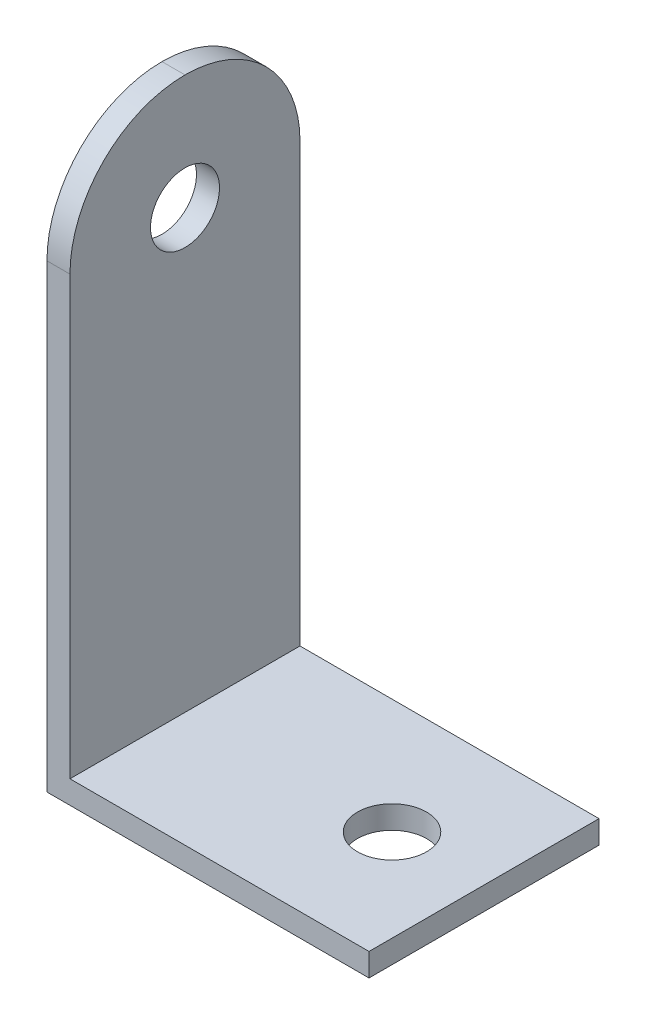
ISO-10303-21;
HEADER;
FILE_DESCRIPTION(('STEP AP214'),'2;1');
FILE_NAME('part.step','',(''),(''),'','','');
FILE_SCHEMA(('AUTOMOTIVE_DESIGN { 1 0 10303 214 1 1 1 1 }'));
ENDSEC;
DATA;
#1=APPLICATION_CONTEXT('core data for automotive mechanical design processes');
#2=APPLICATION_PROTOCOL_DEFINITION('international standard','automotive_design',2000,#1);
#3=PRODUCT_CONTEXT('',#1,'mechanical');
#4=PRODUCT('Part','Part','',(#3));
#5=PRODUCT_RELATED_PRODUCT_CATEGORY('part','',(#4));
#6=PRODUCT_DEFINITION_FORMATION('','',#4);
#7=PRODUCT_DEFINITION_CONTEXT('part definition',#1,'design');
#8=PRODUCT_DEFINITION('design','',#6,#7);
#9=PRODUCT_DEFINITION_SHAPE('','',#8);
#10=(LENGTH_UNIT() NAMED_UNIT(*) SI_UNIT(.MILLI.,.METRE.));
#11=(NAMED_UNIT(*) PLANE_ANGLE_UNIT() SI_UNIT($,.RADIAN.));
#12=(NAMED_UNIT(*) SI_UNIT($,.STERADIAN.) SOLID_ANGLE_UNIT());
#13=UNCERTAINTY_MEASURE_WITH_UNIT(LENGTH_MEASURE(1.E-05),#10,'distance_accuracy_value','');
#14=(GEOMETRIC_REPRESENTATION_CONTEXT(3) GLOBAL_UNCERTAINTY_ASSIGNED_CONTEXT((#13)) GLOBAL_UNIT_ASSIGNED_CONTEXT((#10,
#11,#12)) REPRESENTATION_CONTEXT('',''));
#15=CARTESIAN_POINT('',(0.,0.,0.));
#16=DIRECTION('',(0.,0.,1.));
#17=DIRECTION('',(1.,0.,0.));
#18=AXIS2_PLACEMENT_3D('',#15,#16,#17);
#19=CARTESIAN_POINT('',(14.,0.,10.));
#20=DIRECTION('',(0.,1.,0.));
#21=DIRECTION('',(-1.,0.,0.));
#22=AXIS2_PLACEMENT_3D('',#19,#20,#21);
#23=PLANE('',#22);
#24=CARTESIAN_POINT('',(10.0000000000001,0.,4.99999999999995));
#25=DIRECTION('',(0.,1.,0.));
#26=DIRECTION('',(-1.,0.,0.));
#27=AXIS2_PLACEMENT_3D('',#24,#25,#26);
#28=CIRCLE('',#27,1.5);
#29=CARTESIAN_POINT('',(8.50000000000012,0.,4.99999999999995));
#30=VERTEX_POINT('',#29);
#31=EDGE_CURVE('E227',#30,#30,#28,.T.);
#32=ORIENTED_EDGE('',*,*,#31,.T.);
#33=EDGE_LOOP('',(#32));
#34=FACE_BOUND('',#33,.T.);
#35=DIRECTION('',(1.,0.,0.));
#36=VECTOR('',#35,1.);
#37=CARTESIAN_POINT('',(14.,0.,0.));
#38=LINE('',#37,#36);
#39=CARTESIAN_POINT('',(0.,0.,0.));
#40=VERTEX_POINT('',#39);
#41=CARTESIAN_POINT('',(14.,0.,0.));
#42=VERTEX_POINT('',#41);
#43=EDGE_CURVE('E126',#40,#42,#38,.T.);
#44=ORIENTED_EDGE('',*,*,#43,.T.);
#45=DIRECTION('',(0.,0.,-1.));
#46=VECTOR('',#45,1.);
#47=CARTESIAN_POINT('',(14.,0.,10.));
#48=LINE('',#47,#46);
#49=CARTESIAN_POINT('',(14.,0.,10.));
#50=VERTEX_POINT('',#49);
#51=EDGE_CURVE('E105',#50,#42,#48,.T.);
#52=ORIENTED_EDGE('',*,*,#51,.F.);
#53=DIRECTION('',(1.,0.,0.));
#54=VECTOR('',#53,1.);
#55=CARTESIAN_POINT('',(14.,0.,10.));
#56=LINE('',#55,#54);
#57=CARTESIAN_POINT('',(0.,0.,10.));
#58=VERTEX_POINT('',#57);
#59=EDGE_CURVE('E113',#58,#50,#56,.T.);
#60=ORIENTED_EDGE('',*,*,#59,.F.);
#61=DIRECTION('',(0.,0.,-1.));
#62=VECTOR('',#61,1.);
#63=CARTESIAN_POINT('',(0.,0.,10.));
#64=LINE('',#63,#62);
#65=EDGE_CURVE('E167',#58,#40,#64,.T.);
#66=ORIENTED_EDGE('',*,*,#65,.T.);
#67=EDGE_LOOP('',(#44,#52,#60,#66));
#68=FACE_BOUND('',#67,.T.);
#69=ADVANCED_FACE('F43',(#34,#68),#23,.F.);
#70=CARTESIAN_POINT('',(14.,1.,10.));
#71=DIRECTION('',(-1.,0.,0.));
#72=DIRECTION('',(0.,0.,1.));
#73=AXIS2_PLACEMENT_3D('',#70,#71,#72);
#74=PLANE('',#73);
#75=DIRECTION('',(0.,1.,0.));
#76=VECTOR('',#75,1.);
#77=CARTESIAN_POINT('',(14.,1.,0.));
#78=LINE('',#77,#76);
#79=CARTESIAN_POINT('',(14.,1.,0.));
#80=VERTEX_POINT('',#79);
#81=EDGE_CURVE('E202',#42,#80,#78,.T.);
#82=ORIENTED_EDGE('',*,*,#81,.T.);
#83=DIRECTION('',(0.,0.,-1.));
#84=VECTOR('',#83,1.);
#85=CARTESIAN_POINT('',(14.,1.,10.));
#86=LINE('',#85,#84);
#87=CARTESIAN_POINT('',(14.,1.,10.));
#88=VERTEX_POINT('',#87);
#89=EDGE_CURVE('E108',#88,#80,#86,.T.);
#90=ORIENTED_EDGE('',*,*,#89,.F.);
#91=DIRECTION('',(0.,1.,0.));
#92=VECTOR('',#91,1.);
#93=CARTESIAN_POINT('',(14.,1.,10.));
#94=LINE('',#93,#92);
#95=EDGE_CURVE('E101',#50,#88,#94,.T.);
#96=ORIENTED_EDGE('',*,*,#95,.F.);
#97=ORIENTED_EDGE('',*,*,#51,.T.);
#98=EDGE_LOOP('',(#82,#90,#96,#97));
#99=FACE_BOUND('',#98,.T.);
#100=ADVANCED_FACE('F103',(#99),#74,.F.);
#101=CARTESIAN_POINT('',(1.,1.,10.));
#102=DIRECTION('',(0.,-1.,0.));
#103=DIRECTION('',(0.,0.,-1.));
#104=AXIS2_PLACEMENT_3D('',#101,#102,#103);
#105=PLANE('',#104);
#106=CARTESIAN_POINT('',(10.0000000000001,1.00000000000001,4.99999999999995));
#107=DIRECTION('',(0.,1.,0.));
#108=DIRECTION('',(-1.,0.,0.));
#109=AXIS2_PLACEMENT_3D('',#106,#107,#108);
#110=CIRCLE('',#109,1.5);
#111=CARTESIAN_POINT('',(8.50000000000013,1.00000000000001,4.99999999999995));
#112=VERTEX_POINT('',#111);
#113=EDGE_CURVE('E233',#112,#112,#110,.T.);
#114=ORIENTED_EDGE('',*,*,#113,.F.);
#115=EDGE_LOOP('',(#114));
#116=FACE_BOUND('',#115,.T.);
#117=DIRECTION('',(-1.,0.,0.));
#118=VECTOR('',#117,1.);
#119=CARTESIAN_POINT('',(1.00000000000002,1.,0.));
#120=LINE('',#119,#118);
#121=CARTESIAN_POINT('',(1.00000000000002,1.,0.));
#122=VERTEX_POINT('',#121);
#123=EDGE_CURVE('E197',#80,#122,#120,.T.);
#124=ORIENTED_EDGE('',*,*,#123,.T.);
#125=DIRECTION('',(0.,0.,-1.));
#126=VECTOR('',#125,1.);
#127=CARTESIAN_POINT('',(1.,1.,10.));
#128=LINE('',#127,#126);
#129=CARTESIAN_POINT('',(1.,1.,10.));
#130=VERTEX_POINT('',#129);
#131=EDGE_CURVE('E136',#130,#122,#128,.T.);
#132=ORIENTED_EDGE('',*,*,#131,.F.);
#133=DIRECTION('',(-1.,0.,0.));
#134=VECTOR('',#133,1.);
#135=CARTESIAN_POINT('',(1.,1.,10.));
#136=LINE('',#135,#134);
#137=EDGE_CURVE('E112',#88,#130,#136,.T.);
#138=ORIENTED_EDGE('',*,*,#137,.F.);
#139=ORIENTED_EDGE('',*,*,#89,.T.);
#140=EDGE_LOOP('',(#124,#132,#138,#139));
#141=FACE_BOUND('',#140,.T.);
#142=ADVANCED_FACE('F244',(#116,#141),#105,.F.);
#143=CARTESIAN_POINT('',(1.00000000000001,25.,10.));
#144=DIRECTION('',(-1.,0.,0.));
#145=DIRECTION('',(0.,-1.,0.));
#146=AXIS2_PLACEMENT_3D('',#143,#144,#145);
#147=PLANE('',#146);
#148=CARTESIAN_POINT('',(1.,20.,5.));
#149=DIRECTION('',(1.,0.,0.));
#150=DIRECTION('',(0.,1.,0.));
#151=AXIS2_PLACEMENT_3D('',#148,#149,#150);
#152=CIRCLE('',#151,1.5);
#153=CARTESIAN_POINT('',(1.,21.5,5.));
#154=VERTEX_POINT('',#153);
#155=EDGE_CURVE('E221',#154,#154,#152,.T.);
#156=ORIENTED_EDGE('',*,*,#155,.F.);
#157=EDGE_LOOP('',(#156));
#158=FACE_BOUND('',#157,.T.);
#159=DIRECTION('',(0.,1.,0.));
#160=VECTOR('',#159,1.);
#161=CARTESIAN_POINT('',(1.00000000000001,25.,0.));
#162=LINE('',#161,#160);
#163=CARTESIAN_POINT('',(1.,20.,0.));
#164=VERTEX_POINT('',#163);
#165=EDGE_CURVE('E192',#122,#164,#162,.T.);
#166=ORIENTED_EDGE('',*,*,#165,.T.);
#167=CARTESIAN_POINT('',(1.,20.,5.));
#168=DIRECTION('',(-1.,0.,0.));
#169=DIRECTION('',(0.,-1.,0.));
#170=AXIS2_PLACEMENT_3D('',#167,#168,#169);
#171=CIRCLE('',#170,5.);
#172=CARTESIAN_POINT('',(1.00000000000001,25.,4.99999999999991));
#173=VERTEX_POINT('',#172);
#174=EDGE_CURVE('E53',#164,#173,#171,.F.);
#175=ORIENTED_EDGE('',*,*,#174,.T.);
#176=CARTESIAN_POINT('',(1.,20.,5.));
#177=DIRECTION('',(-1.,0.,0.));
#178=DIRECTION('',(0.,-1.,0.));
#179=AXIS2_PLACEMENT_3D('',#176,#177,#178);
#180=CIRCLE('',#179,5.);
#181=CARTESIAN_POINT('',(1.00000000000001,20.,9.99999999999998));
#182=VERTEX_POINT('',#181);
#183=EDGE_CURVE('E60',#173,#182,#180,.F.);
#184=ORIENTED_EDGE('',*,*,#183,.T.);
#185=DIRECTION('',(0.,1.,0.));
#186=VECTOR('',#185,1.);
#187=CARTESIAN_POINT('',(1.00000000000001,25.,10.));
#188=LINE('',#187,#186);
#189=EDGE_CURVE('E175',#130,#182,#188,.T.);
#190=ORIENTED_EDGE('',*,*,#189,.F.);
#191=ORIENTED_EDGE('',*,*,#131,.T.);
#192=EDGE_LOOP('',(#166,#175,#184,#190,#191));
#193=FACE_BOUND('',#192,.T.);
#194=ADVANCED_FACE('F247',(#158,#193),#147,.F.);
#195=CARTESIAN_POINT('',(0.,0.,10.));
#196=DIRECTION('',(1.,0.,0.));
#197=DIRECTION('',(0.,1.,0.));
#198=AXIS2_PLACEMENT_3D('',#195,#196,#197);
#199=PLANE('',#198);
#200=CARTESIAN_POINT('',(0.,20.,5.));
#201=DIRECTION('',(1.,0.,0.));
#202=DIRECTION('',(0.,1.,0.));
#203=AXIS2_PLACEMENT_3D('',#200,#201,#202);
#204=CIRCLE('',#203,1.5);
#205=CARTESIAN_POINT('',(0.,21.5,5.));
#206=VERTEX_POINT('',#205);
#207=EDGE_CURVE('E216',#206,#206,#204,.T.);
#208=ORIENTED_EDGE('',*,*,#207,.T.);
#209=EDGE_LOOP('',(#208));
#210=FACE_BOUND('',#209,.T.);
#211=CARTESIAN_POINT('',(0.,20.,5.));
#212=DIRECTION('',(1.,0.,0.));
#213=DIRECTION('',(0.,1.,0.));
#214=AXIS2_PLACEMENT_3D('',#211,#212,#213);
#215=CIRCLE('',#214,5.);
#216=CARTESIAN_POINT('',(0.,20.,10.));
#217=VERTEX_POINT('',#216);
#218=CARTESIAN_POINT('',(0.,25.,4.99999999999996));
#219=VERTEX_POINT('',#218);
#220=EDGE_CURVE('E128',#217,#219,#215,.F.);
#221=ORIENTED_EDGE('',*,*,#220,.T.);
#222=CARTESIAN_POINT('',(0.,20.,5.));
#223=DIRECTION('',(1.,0.,0.));
#224=DIRECTION('',(0.,1.,0.));
#225=AXIS2_PLACEMENT_3D('',#222,#223,#224);
#226=CIRCLE('',#225,5.);
#227=CARTESIAN_POINT('',(0.,20.,0.));
#228=VERTEX_POINT('',#227);
#229=EDGE_CURVE('E134',#219,#228,#226,.F.);
#230=ORIENTED_EDGE('',*,*,#229,.T.);
#231=DIRECTION('',(0.,-1.,0.));
#232=VECTOR('',#231,1.);
#233=CARTESIAN_POINT('',(0.,0.,0.));
#234=LINE('',#233,#232);
#235=EDGE_CURVE('E123',#228,#40,#234,.T.);
#236=ORIENTED_EDGE('',*,*,#235,.T.);
#237=ORIENTED_EDGE('',*,*,#65,.F.);
#238=DIRECTION('',(0.,-1.,0.));
#239=VECTOR('',#238,1.);
#240=CARTESIAN_POINT('',(0.,0.,10.));
#241=LINE('',#240,#239);
#242=EDGE_CURVE('E118',#217,#58,#241,.T.);
#243=ORIENTED_EDGE('',*,*,#242,.F.);
#244=EDGE_LOOP('',(#221,#230,#236,#237,#243));
#245=FACE_BOUND('',#244,.T.);
#246=ADVANCED_FACE('F264',(#210,#245),#199,.F.);
#247=CARTESIAN_POINT('',(0.,0.,10.));
#248=DIRECTION('',(0.,0.,-1.));
#249=DIRECTION('',(-1.,0.,0.));
#250=AXIS2_PLACEMENT_3D('',#247,#248,#249);
#251=PLANE('',#250);
#252=ORIENTED_EDGE('',*,*,#189,.T.);
#253=DIRECTION('',(-1.,0.,0.));
#254=VECTOR('',#253,1.);
#255=CARTESIAN_POINT('',(0.,20.,10.));
#256=LINE('',#255,#254);
#257=EDGE_CURVE('E11',#182,#217,#256,.T.);
#258=ORIENTED_EDGE('',*,*,#257,.T.);
#259=ORIENTED_EDGE('',*,*,#242,.T.);
#260=ORIENTED_EDGE('',*,*,#59,.T.);
#261=ORIENTED_EDGE('',*,*,#95,.T.);
#262=ORIENTED_EDGE('',*,*,#137,.T.);
#263=EDGE_LOOP('',(#252,#258,#259,#260,#261,#262));
#264=FACE_BOUND('',#263,.T.);
#265=ADVANCED_FACE('F116',(#264),#251,.F.);
#266=CARTESIAN_POINT('',(0.,0.,0.));
#267=DIRECTION('',(0.,0.,-1.));
#268=DIRECTION('',(-1.,0.,0.));
#269=AXIS2_PLACEMENT_3D('',#266,#267,#268);
#270=PLANE('',#269);
#271=ORIENTED_EDGE('',*,*,#235,.F.);
#272=DIRECTION('',(-1.,0.,0.));
#273=VECTOR('',#272,1.);
#274=CARTESIAN_POINT('',(1.,20.,0.));
#275=LINE('',#274,#273);
#276=EDGE_CURVE('E142',#228,#164,#275,.F.);
#277=ORIENTED_EDGE('',*,*,#276,.T.);
#278=ORIENTED_EDGE('',*,*,#165,.F.);
#279=ORIENTED_EDGE('',*,*,#123,.F.);
#280=ORIENTED_EDGE('',*,*,#81,.F.);
#281=ORIENTED_EDGE('',*,*,#43,.F.);
#282=EDGE_LOOP('',(#271,#277,#278,#279,#280,#281));
#283=FACE_BOUND('',#282,.T.);
#284=ADVANCED_FACE('F254',(#283),#270,.T.);
#285=CARTESIAN_POINT('',(1.11022302462516E-13,20.,5.00000000000003));
#286=DIRECTION('',(-1.,0.,0.));
#287=DIRECTION('',(0.,0.,1.));
#288=AXIS2_PLACEMENT_3D('',#285,#286,#287);
#289=CYLINDRICAL_SURFACE('',#288,5.);
#290=ORIENTED_EDGE('',*,*,#257,.F.);
#291=ORIENTED_EDGE('',*,*,#183,.F.);
#292=DIRECTION('',(-1.,0.,0.));
#293=VECTOR('',#292,1.);
#294=CARTESIAN_POINT('',(0.,25.,4.99999999999996));
#295=LINE('',#294,#293);
#296=EDGE_CURVE('E47',#219,#173,#295,.F.);
#297=ORIENTED_EDGE('',*,*,#296,.F.);
#298=ORIENTED_EDGE('',*,*,#220,.F.);
#299=EDGE_LOOP('',(#290,#291,#297,#298));
#300=FACE_BOUND('',#299,.T.);
#301=ADVANCED_FACE('F45',(#300),#289,.T.);
#302=CARTESIAN_POINT('',(0.,20.,5.));
#303=DIRECTION('',(1.,0.,0.));
#304=DIRECTION('',(0.,0.,-1.));
#305=AXIS2_PLACEMENT_3D('',#302,#303,#304);
#306=CYLINDRICAL_SURFACE('',#305,5.);
#307=ORIENTED_EDGE('',*,*,#174,.F.);
#308=ORIENTED_EDGE('',*,*,#276,.F.);
#309=ORIENTED_EDGE('',*,*,#229,.F.);
#310=ORIENTED_EDGE('',*,*,#296,.T.);
#311=EDGE_LOOP('',(#307,#308,#309,#310));
#312=FACE_BOUND('',#311,.T.);
#313=ADVANCED_FACE('F258',(#312),#306,.T.);
#314=CARTESIAN_POINT('',(0.,20.,5.));
#315=DIRECTION('',(1.,0.,0.));
#316=DIRECTION('',(0.,1.,0.));
#317=AXIS2_PLACEMENT_3D('',#314,#315,#316);
#318=CYLINDRICAL_SURFACE('',#317,1.5);
#319=ORIENTED_EDGE('',*,*,#207,.F.);
#320=EDGE_LOOP('',(#319));
#321=FACE_BOUND('',#320,.T.);
#322=ORIENTED_EDGE('',*,*,#155,.T.);
#323=EDGE_LOOP('',(#322));
#324=FACE_BOUND('',#323,.T.);
#325=ADVANCED_FACE('F284',(#321,#324),#318,.F.);
#326=CARTESIAN_POINT('',(10.0000000000001,0.,4.99999999999995));
#327=DIRECTION('',(0.,1.,0.));
#328=DIRECTION('',(-1.,0.,0.));
#329=AXIS2_PLACEMENT_3D('',#326,#327,#328);
#330=CYLINDRICAL_SURFACE('',#329,1.5);
#331=ORIENTED_EDGE('',*,*,#31,.F.);
#332=EDGE_LOOP('',(#331));
#333=FACE_BOUND('',#332,.T.);
#334=ORIENTED_EDGE('',*,*,#113,.T.);
#335=EDGE_LOOP('',(#334));
#336=FACE_BOUND('',#335,.T.);
#337=ADVANCED_FACE('F242',(#333,#336),#330,.F.);
#338=CLOSED_SHELL('',(#69,#100,#142,#194,#246,#265,#284,#301,#313,#325,#337));
#339=MANIFOLD_SOLID_BREP('B2',#338);
#340=ADVANCED_BREP_SHAPE_REPRESENTATION('',(#18,#339),#14);
#341=SHAPE_DEFINITION_REPRESENTATION(#9,#340);
ENDSEC;
END-ISO-10303-21;
